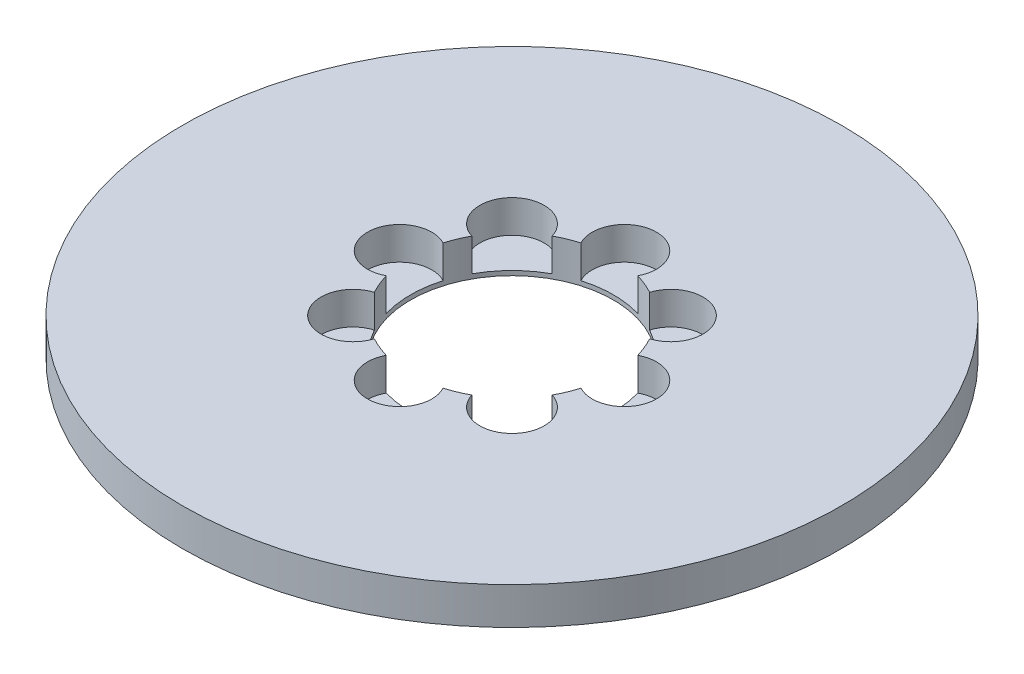
ISO-10303-21;
HEADER;
FILE_DESCRIPTION(('STEP AP214'),'2;1');
FILE_NAME('part.step','',(''),(''),'','','');
FILE_SCHEMA(('AUTOMOTIVE_DESIGN { 1 0 10303 214 1 1 1 1 }'));
ENDSEC;
DATA;
#1=APPLICATION_CONTEXT('core data for automotive mechanical design processes');
#2=APPLICATION_PROTOCOL_DEFINITION('international standard','automotive_design',2000,#1);
#3=PRODUCT_CONTEXT('',#1,'mechanical');
#4=PRODUCT('Part','Part','',(#3));
#5=PRODUCT_RELATED_PRODUCT_CATEGORY('part','',(#4));
#6=PRODUCT_DEFINITION_FORMATION('','',#4);
#7=PRODUCT_DEFINITION_CONTEXT('part definition',#1,'design');
#8=PRODUCT_DEFINITION('design','',#6,#7);
#9=PRODUCT_DEFINITION_SHAPE('','',#8);
#10=(LENGTH_UNIT() NAMED_UNIT(*) SI_UNIT(.MILLI.,.METRE.));
#11=(NAMED_UNIT(*) PLANE_ANGLE_UNIT() SI_UNIT($,.RADIAN.));
#12=(NAMED_UNIT(*) SI_UNIT($,.STERADIAN.) SOLID_ANGLE_UNIT());
#13=UNCERTAINTY_MEASURE_WITH_UNIT(LENGTH_MEASURE(1.E-05),#10,'distance_accuracy_value','');
#14=(GEOMETRIC_REPRESENTATION_CONTEXT(3) GLOBAL_UNCERTAINTY_ASSIGNED_CONTEXT((#13)) GLOBAL_UNIT_ASSIGNED_CONTEXT((#10,
#11,#12)) REPRESENTATION_CONTEXT('',''));
#15=CARTESIAN_POINT('',(0.,0.,0.));
#16=DIRECTION('',(0.,0.,1.));
#17=DIRECTION('',(1.,0.,0.));
#18=AXIS2_PLACEMENT_3D('',#15,#16,#17);
#19=CARTESIAN_POINT('',(0.,11.,0.));
#20=DIRECTION('',(0.,-1.,0.));
#21=DIRECTION('',(0.,0.,-1.));
#22=AXIS2_PLACEMENT_3D('',#19,#20,#21);
#23=CYLINDRICAL_SURFACE('',#22,97.5);
#24=CARTESIAN_POINT('',(0.,11.,0.));
#25=DIRECTION('',(0.,1.,0.));
#26=DIRECTION('',(0.,0.,1.));
#27=AXIS2_PLACEMENT_3D('',#24,#25,#26);
#28=CIRCLE('',#27,97.5);
#29=CARTESIAN_POINT('',(0.,11.,97.5));
#30=VERTEX_POINT('',#29);
#31=EDGE_CURVE('E195',#30,#30,#28,.T.);
#32=ORIENTED_EDGE('',*,*,#31,.F.);
#33=EDGE_LOOP('',(#32));
#34=FACE_BOUND('',#33,.T.);
#35=CARTESIAN_POINT('',(0.,0.,0.));
#36=DIRECTION('',(0.,1.,0.));
#37=DIRECTION('',(0.,0.,1.));
#38=AXIS2_PLACEMENT_3D('',#35,#36,#37);
#39=CIRCLE('',#38,97.5);
#40=CARTESIAN_POINT('',(0.,0.,97.5));
#41=VERTEX_POINT('',#40);
#42=EDGE_CURVE('E179',#41,#41,#39,.T.);
#43=ORIENTED_EDGE('',*,*,#42,.T.);
#44=EDGE_LOOP('',(#43));
#45=FACE_BOUND('',#44,.T.);
#46=ADVANCED_FACE('F39',(#34,#45),#23,.T.);
#47=CARTESIAN_POINT('',(0.,11.,0.));
#48=DIRECTION('',(0.,1.,0.));
#49=DIRECTION('',(0.,0.,1.));
#50=AXIS2_PLACEMENT_3D('',#47,#48,#49);
#51=PLANE('',#50);
#52=CARTESIAN_POINT('',(1.16039315757414E-13,11.,33.2349809424624));
#53=DIRECTION('',(0.,1.,0.));
#54=DIRECTION('',(1.,0.,0.));
#55=AXIS2_PLACEMENT_3D('',#52,#53,#54);
#56=CIRCLE('',#55,9.51243679470091);
#57=CARTESIAN_POINT('',(-8.41326540884641,11.,28.7961276070292));
#58=VERTEX_POINT('',#57);
#59=CARTESIAN_POINT('',(8.41326540884661,11.,28.7961276070291));
#60=VERTEX_POINT('',#59);
#61=EDGE_CURVE('E176',#58,#60,#56,.T.);
#62=ORIENTED_EDGE('',*,*,#61,.F.);
#63=CARTESIAN_POINT('',(0.,11.,0.));
#64=DIRECTION('',(0.,1.,0.));
#65=DIRECTION('',(0.,0.,1.));
#66=AXIS2_PLACEMENT_3D('',#63,#64,#65);
#67=CIRCLE('',#66,30.);
#68=CARTESIAN_POINT('',(-14.4128600803258,11.,26.3110141253611));
#69=VERTEX_POINT('',#68);
#70=EDGE_CURVE('E166',#69,#58,#67,.T.);
#71=ORIENTED_EDGE('',*,*,#70,.F.);
#72=CARTESIAN_POINT('',(-23.5006803970208,11.,23.5006803970209));
#73=DIRECTION('',(0.,1.,0.));
#74=DIRECTION('',(0.707106781186549,0.,0.707106781186546));
#75=AXIS2_PLACEMENT_3D('',#72,#73,#74);
#76=CIRCLE('',#75,9.51243679470091);
#77=CARTESIAN_POINT('',(-26.311014125361,11.,14.4128600803259));
#78=VERTEX_POINT('',#77);
#79=EDGE_CURVE('E147',#78,#69,#76,.T.);
#80=ORIENTED_EDGE('',*,*,#79,.F.);
#81=CARTESIAN_POINT('',(-28.7961276070292,11.,8.41326540884651));
#82=VERTEX_POINT('',#81);
#83=EDGE_CURVE('E180',#82,#78,#67,.T.);
#84=ORIENTED_EDGE('',*,*,#83,.F.);
#85=CARTESIAN_POINT('',(-33.2349809424624,11.,0.));
#86=DIRECTION('',(0.,1.,0.));
#87=DIRECTION('',(0.,0.,1.));
#88=AXIS2_PLACEMENT_3D('',#85,#86,#87);
#89=CIRCLE('',#88,9.51243679470091);
#90=CARTESIAN_POINT('',(-28.7961276070292,11.,-8.41326540884651));
#91=VERTEX_POINT('',#90);
#92=EDGE_CURVE('E186',#91,#82,#89,.T.);
#93=ORIENTED_EDGE('',*,*,#92,.F.);
#94=CARTESIAN_POINT('',(-26.3110141253612,11.,-14.4128600803256));
#95=VERTEX_POINT('',#94);
#96=EDGE_CURVE('E182',#95,#91,#67,.T.);
#97=ORIENTED_EDGE('',*,*,#96,.F.);
#98=CARTESIAN_POINT('',(-23.5006803970211,11.,-23.5006803970205));
#99=DIRECTION('',(0.,1.,0.));
#100=DIRECTION('',(-0.707106781186539,0.,0.707106781186556));
#101=AXIS2_PLACEMENT_3D('',#98,#99,#100);
#102=CIRCLE('',#101,9.51243679470091);
#103=CARTESIAN_POINT('',(-14.4128600803262,11.,-26.3110141253609));
#104=VERTEX_POINT('',#103);
#105=EDGE_CURVE('E446',#104,#95,#102,.T.);
#106=ORIENTED_EDGE('',*,*,#105,.F.);
#107=CARTESIAN_POINT('',(-8.41326540884681,11.,-28.7961276070291));
#108=VERTEX_POINT('',#107);
#109=EDGE_CURVE('E452',#108,#104,#67,.T.);
#110=ORIENTED_EDGE('',*,*,#109,.F.);
#111=CARTESIAN_POINT('',(-3.48117947272244E-13,11.,-33.2349809424624));
#112=DIRECTION('',(0.,1.,0.));
#113=DIRECTION('',(-1.,0.,0.));
#114=AXIS2_PLACEMENT_3D('',#111,#112,#113);
#115=CIRCLE('',#114,9.51243679470091);
#116=CARTESIAN_POINT('',(8.4132654088462,11.,-28.7961276070292));
#117=VERTEX_POINT('',#116);
#118=EDGE_CURVE('E477',#117,#108,#115,.T.);
#119=ORIENTED_EDGE('',*,*,#118,.F.);
#120=CARTESIAN_POINT('',(14.4128600803257,11.,-26.3110141253612));
#121=VERTEX_POINT('',#120);
#122=EDGE_CURVE('E460',#121,#117,#67,.T.);
#123=ORIENTED_EDGE('',*,*,#122,.F.);
#124=CARTESIAN_POINT('',(23.5006803970206,11.,-23.500680397021));
#125=DIRECTION('',(0.,1.,0.));
#126=DIRECTION('',(-0.707106781186554,0.,-0.707106781186541));
#127=AXIS2_PLACEMENT_3D('',#124,#125,#126);
#128=CIRCLE('',#127,9.51243679470091);
#129=CARTESIAN_POINT('',(26.3110141253609,11.,-14.4128600803261));
#130=VERTEX_POINT('',#129);
#131=EDGE_CURVE('E464',#130,#121,#128,.T.);
#132=ORIENTED_EDGE('',*,*,#131,.F.);
#133=CARTESIAN_POINT('',(28.7961276070292,11.,-8.41326540884651));
#134=VERTEX_POINT('',#133);
#135=EDGE_CURVE('E459',#134,#130,#67,.T.);
#136=ORIENTED_EDGE('',*,*,#135,.F.);
#137=CARTESIAN_POINT('',(33.2349809424624,11.,0.));
#138=DIRECTION('',(0.,1.,0.));
#139=DIRECTION('',(0.,0.,-1.));
#140=AXIS2_PLACEMENT_3D('',#137,#138,#139);
#141=CIRCLE('',#140,9.51243679470091);
#142=CARTESIAN_POINT('',(28.7961276070292,11.,8.41326540884651));
#143=VERTEX_POINT('',#142);
#144=EDGE_CURVE('E469',#143,#134,#141,.T.);
#145=ORIENTED_EDGE('',*,*,#144,.F.);
#146=CARTESIAN_POINT('',(26.3110141253611,11.,14.4128600803258));
#147=VERTEX_POINT('',#146);
#148=EDGE_CURVE('E181',#147,#143,#67,.T.);
#149=ORIENTED_EDGE('',*,*,#148,.F.);
#150=CARTESIAN_POINT('',(23.5006803970209,11.,23.5006803970207));
#151=DIRECTION('',(0.,1.,0.));
#152=DIRECTION('',(0.707106781186544,0.,-0.707106781186551));
#153=AXIS2_PLACEMENT_3D('',#150,#151,#152);
#154=CIRCLE('',#153,9.51243679470091);
#155=CARTESIAN_POINT('',(14.412860080326,11.,26.311014125361));
#156=VERTEX_POINT('',#155);
#157=EDGE_CURVE('E475',#156,#147,#154,.T.);
#158=ORIENTED_EDGE('',*,*,#157,.F.);
#159=EDGE_CURVE('E177',#60,#156,#67,.T.);
#160=ORIENTED_EDGE('',*,*,#159,.F.);
#161=EDGE_LOOP('',(#62,#71,#80,#84,#93,#97,#106,#110,#119,#123,#132,#136,#145,#149,#158,#160));
#162=FACE_BOUND('',#161,.T.);
#163=ORIENTED_EDGE('',*,*,#31,.T.);
#164=EDGE_LOOP('',(#163));
#165=FACE_BOUND('',#164,.T.);
#166=ADVANCED_FACE('F172',(#162,#165),#51,.T.);
#167=CARTESIAN_POINT('',(0.,0.,0.));
#168=DIRECTION('',(0.,1.,0.));
#169=DIRECTION('',(0.,0.,1.));
#170=AXIS2_PLACEMENT_3D('',#167,#168,#169);
#171=PLANE('',#170);
#172=CARTESIAN_POINT('',(0.,0.,0.));
#173=DIRECTION('',(0.,1.,0.));
#174=DIRECTION('',(0.,0.,1.));
#175=AXIS2_PLACEMENT_3D('',#172,#173,#174);
#176=CIRCLE('',#175,30.);
#177=CARTESIAN_POINT('',(0.,0.,30.));
#178=VERTEX_POINT('',#177);
#179=EDGE_CURVE('E187',#178,#178,#176,.T.);
#180=ORIENTED_EDGE('',*,*,#179,.T.);
#181=EDGE_LOOP('',(#180));
#182=FACE_BOUND('',#181,.T.);
#183=ORIENTED_EDGE('',*,*,#42,.F.);
#184=EDGE_LOOP('',(#183));
#185=FACE_BOUND('',#184,.T.);
#186=ADVANCED_FACE('F270',(#182,#185),#171,.F.);
#187=CARTESIAN_POINT('',(0.,11.,0.));
#188=DIRECTION('',(0.,-1.,0.));
#189=DIRECTION('',(0.,0.,-1.));
#190=AXIS2_PLACEMENT_3D('',#187,#188,#189);
#191=CYLINDRICAL_SURFACE('',#190,30.);
#192=DIRECTION('',(0.,1.,0.));
#193=VECTOR('',#192,1.);
#194=CARTESIAN_POINT('',(-8.41326540884641,6.16684092337857,28.7961276070292));
#195=LINE('',#194,#193);
#196=CARTESIAN_POINT('',(-8.41326540884641,1.33368184675714,28.7961276070292));
#197=VERTEX_POINT('',#196);
#198=EDGE_CURVE('E11',#197,#58,#195,.T.);
#199=ORIENTED_EDGE('',*,*,#198,.F.);
#200=CARTESIAN_POINT('',(0.,1.33368184675714,0.));
#201=DIRECTION('',(0.,1.,0.));
#202=DIRECTION('',(0.,0.,1.));
#203=AXIS2_PLACEMENT_3D('',#200,#201,#202);
#204=CIRCLE('',#203,30.);
#205=CARTESIAN_POINT('',(8.41326540884661,1.33368184675714,28.7961276070291));
#206=VERTEX_POINT('',#205);
#207=EDGE_CURVE('E250',#197,#206,#204,.T.);
#208=ORIENTED_EDGE('',*,*,#207,.T.);
#209=DIRECTION('',(0.,1.,0.));
#210=VECTOR('',#209,1.);
#211=CARTESIAN_POINT('',(8.41326540884661,6.16684092337857,28.7961276070291));
#212=LINE('',#211,#210);
#213=EDGE_CURVE('E46',#60,#206,#212,.F.);
#214=ORIENTED_EDGE('',*,*,#213,.F.);
#215=ORIENTED_EDGE('',*,*,#159,.T.);
#216=DIRECTION('',(0.,1.,0.));
#217=VECTOR('',#216,1.);
#218=CARTESIAN_POINT('',(14.412860080326,6.16684092337857,26.311014125361));
#219=LINE('',#218,#217);
#220=CARTESIAN_POINT('',(14.412860080326,1.33368184675714,26.311014125361));
#221=VERTEX_POINT('',#220);
#222=EDGE_CURVE('E244',#221,#156,#219,.T.);
#223=ORIENTED_EDGE('',*,*,#222,.F.);
#224=CARTESIAN_POINT('',(0.,1.33368184675714,0.));
#225=DIRECTION('',(0.,1.,0.));
#226=DIRECTION('',(0.,0.,1.));
#227=AXIS2_PLACEMENT_3D('',#224,#225,#226);
#228=CIRCLE('',#227,30.);
#229=CARTESIAN_POINT('',(26.3110141253611,1.33368184675714,14.4128600803258));
#230=VERTEX_POINT('',#229);
#231=EDGE_CURVE('E238',#221,#230,#228,.T.);
#232=ORIENTED_EDGE('',*,*,#231,.T.);
#233=DIRECTION('',(0.,1.,0.));
#234=VECTOR('',#233,1.);
#235=CARTESIAN_POINT('',(26.3110141253611,6.16684092337857,14.4128600803258));
#236=LINE('',#235,#234);
#237=EDGE_CURVE('E242',#147,#230,#236,.F.);
#238=ORIENTED_EDGE('',*,*,#237,.F.);
#239=ORIENTED_EDGE('',*,*,#148,.T.);
#240=DIRECTION('',(0.,1.,0.));
#241=VECTOR('',#240,1.);
#242=CARTESIAN_POINT('',(28.7961276070292,6.16684092337857,8.41326540884651));
#243=LINE('',#242,#241);
#244=CARTESIAN_POINT('',(28.7961276070292,1.33368184675714,8.41326540884651));
#245=VERTEX_POINT('',#244);
#246=EDGE_CURVE('E236',#245,#143,#243,.T.);
#247=ORIENTED_EDGE('',*,*,#246,.F.);
#248=CARTESIAN_POINT('',(0.,1.33368184675714,0.));
#249=DIRECTION('',(0.,1.,0.));
#250=DIRECTION('',(0.,0.,1.));
#251=AXIS2_PLACEMENT_3D('',#248,#249,#250);
#252=CIRCLE('',#251,30.);
#253=CARTESIAN_POINT('',(28.7961276070292,1.33368184675714,-8.41326540884651));
#254=VERTEX_POINT('',#253);
#255=EDGE_CURVE('E235',#245,#254,#252,.T.);
#256=ORIENTED_EDGE('',*,*,#255,.T.);
#257=DIRECTION('',(0.,1.,0.));
#258=VECTOR('',#257,1.);
#259=CARTESIAN_POINT('',(28.7961276070292,6.16684092337857,-8.41326540884651));
#260=LINE('',#259,#258);
#261=EDGE_CURVE('E234',#134,#254,#260,.F.);
#262=ORIENTED_EDGE('',*,*,#261,.F.);
#263=ORIENTED_EDGE('',*,*,#135,.T.);
#264=DIRECTION('',(0.,1.,0.));
#265=VECTOR('',#264,1.);
#266=CARTESIAN_POINT('',(26.3110141253609,6.16684092337857,-14.4128600803261));
#267=LINE('',#266,#265);
#268=CARTESIAN_POINT('',(26.3110141253609,1.33368184675714,-14.4128600803261));
#269=VERTEX_POINT('',#268);
#270=EDGE_CURVE('E229',#269,#130,#267,.T.);
#271=ORIENTED_EDGE('',*,*,#270,.F.);
#272=CARTESIAN_POINT('',(0.,1.33368184675714,0.));
#273=DIRECTION('',(0.,1.,0.));
#274=DIRECTION('',(0.,0.,1.));
#275=AXIS2_PLACEMENT_3D('',#272,#273,#274);
#276=CIRCLE('',#275,30.);
#277=CARTESIAN_POINT('',(14.4128600803257,1.33368184675714,-26.3110141253612));
#278=VERTEX_POINT('',#277);
#279=EDGE_CURVE('E221',#269,#278,#276,.T.);
#280=ORIENTED_EDGE('',*,*,#279,.T.);
#281=DIRECTION('',(0.,1.,0.));
#282=VECTOR('',#281,1.);
#283=CARTESIAN_POINT('',(14.4128600803257,6.16684092337857,-26.3110141253612));
#284=LINE('',#283,#282);
#285=EDGE_CURVE('E230',#121,#278,#284,.F.);
#286=ORIENTED_EDGE('',*,*,#285,.F.);
#287=ORIENTED_EDGE('',*,*,#122,.T.);
#288=DIRECTION('',(0.,1.,0.));
#289=VECTOR('',#288,1.);
#290=CARTESIAN_POINT('',(8.41326540884621,6.16684092337857,-28.7961276070292));
#291=LINE('',#290,#289);
#292=CARTESIAN_POINT('',(8.4132654088462,1.33368184675714,-28.7961276070292));
#293=VERTEX_POINT('',#292);
#294=EDGE_CURVE('E225',#293,#117,#291,.T.);
#295=ORIENTED_EDGE('',*,*,#294,.F.);
#296=CARTESIAN_POINT('',(0.,1.33368184675714,0.));
#297=DIRECTION('',(0.,1.,0.));
#298=DIRECTION('',(0.,0.,1.));
#299=AXIS2_PLACEMENT_3D('',#296,#297,#298);
#300=CIRCLE('',#299,30.);
#301=CARTESIAN_POINT('',(-8.41326540884681,1.33368184675714,-28.7961276070291));
#302=VERTEX_POINT('',#301);
#303=EDGE_CURVE('E216',#293,#302,#300,.T.);
#304=ORIENTED_EDGE('',*,*,#303,.T.);
#305=DIRECTION('',(0.,1.,0.));
#306=VECTOR('',#305,1.);
#307=CARTESIAN_POINT('',(-8.41326540884681,6.16684092337857,-28.7961276070291));
#308=LINE('',#307,#306);
#309=EDGE_CURVE('E218',#108,#302,#308,.F.);
#310=ORIENTED_EDGE('',*,*,#309,.F.);
#311=ORIENTED_EDGE('',*,*,#109,.T.);
#312=DIRECTION('',(0.,1.,0.));
#313=VECTOR('',#312,1.);
#314=CARTESIAN_POINT('',(-14.4128600803262,6.16684092337857,-26.3110141253609));
#315=LINE('',#314,#313);
#316=CARTESIAN_POINT('',(-14.4128600803262,1.33368184675714,-26.3110141253609));
#317=VERTEX_POINT('',#316);
#318=EDGE_CURVE('E212',#317,#104,#315,.T.);
#319=ORIENTED_EDGE('',*,*,#318,.F.);
#320=CARTESIAN_POINT('',(0.,1.33368184675714,0.));
#321=DIRECTION('',(0.,1.,0.));
#322=DIRECTION('',(0.,0.,1.));
#323=AXIS2_PLACEMENT_3D('',#320,#321,#322);
#324=CIRCLE('',#323,30.);
#325=CARTESIAN_POINT('',(-26.3110141253612,1.33368184675714,-14.4128600803256));
#326=VERTEX_POINT('',#325);
#327=EDGE_CURVE('E208',#317,#326,#324,.T.);
#328=ORIENTED_EDGE('',*,*,#327,.T.);
#329=DIRECTION('',(0.,1.,0.));
#330=VECTOR('',#329,1.);
#331=CARTESIAN_POINT('',(-26.3110141253612,6.16684092337857,-14.4128600803256));
#332=LINE('',#331,#330);
#333=EDGE_CURVE('E211',#95,#326,#332,.F.);
#334=ORIENTED_EDGE('',*,*,#333,.F.);
#335=ORIENTED_EDGE('',*,*,#96,.T.);
#336=DIRECTION('',(0.,1.,0.));
#337=VECTOR('',#336,1.);
#338=CARTESIAN_POINT('',(-28.7961276070292,6.16684092337857,-8.41326540884651));
#339=LINE('',#338,#337);
#340=CARTESIAN_POINT('',(-28.7961276070292,1.33368184675714,-8.41326540884651));
#341=VERTEX_POINT('',#340);
#342=EDGE_CURVE('E201',#341,#91,#339,.T.);
#343=ORIENTED_EDGE('',*,*,#342,.F.);
#344=CARTESIAN_POINT('',(0.,1.33368184675714,0.));
#345=DIRECTION('',(0.,1.,0.));
#346=DIRECTION('',(0.,0.,1.));
#347=AXIS2_PLACEMENT_3D('',#344,#345,#346);
#348=CIRCLE('',#347,30.);
#349=CARTESIAN_POINT('',(-28.7961276070292,1.33368184675714,8.41326540884651));
#350=VERTEX_POINT('',#349);
#351=EDGE_CURVE('E194',#341,#350,#348,.T.);
#352=ORIENTED_EDGE('',*,*,#351,.T.);
#353=DIRECTION('',(0.,1.,0.));
#354=VECTOR('',#353,1.);
#355=CARTESIAN_POINT('',(-28.7961276070292,6.16684092337857,8.41326540884651));
#356=LINE('',#355,#354);
#357=EDGE_CURVE('E199',#82,#350,#356,.F.);
#358=ORIENTED_EDGE('',*,*,#357,.F.);
#359=ORIENTED_EDGE('',*,*,#83,.T.);
#360=DIRECTION('',(0.,1.,0.));
#361=VECTOR('',#360,1.);
#362=CARTESIAN_POINT('',(-26.311014125361,6.16684092337857,14.4128600803259));
#363=LINE('',#362,#361);
#364=CARTESIAN_POINT('',(-26.311014125361,1.33368184675714,14.4128600803259));
#365=VERTEX_POINT('',#364);
#366=EDGE_CURVE('E160',#365,#78,#363,.T.);
#367=ORIENTED_EDGE('',*,*,#366,.F.);
#368=CARTESIAN_POINT('',(0.,1.33368184675714,0.));
#369=DIRECTION('',(0.,1.,0.));
#370=DIRECTION('',(0.,0.,1.));
#371=AXIS2_PLACEMENT_3D('',#368,#369,#370);
#372=CIRCLE('',#371,30.);
#373=CARTESIAN_POINT('',(-14.4128600803258,1.33368184675714,26.3110141253611));
#374=VERTEX_POINT('',#373);
#375=EDGE_CURVE('E168',#365,#374,#372,.T.);
#376=ORIENTED_EDGE('',*,*,#375,.T.);
#377=DIRECTION('',(0.,1.,0.));
#378=VECTOR('',#377,1.);
#379=CARTESIAN_POINT('',(-14.4128600803258,6.16684092337857,26.3110141253611));
#380=LINE('',#379,#378);
#381=EDGE_CURVE('E152',#69,#374,#380,.F.);
#382=ORIENTED_EDGE('',*,*,#381,.F.);
#383=ORIENTED_EDGE('',*,*,#70,.T.);
#384=EDGE_LOOP('',(#199,#208,#214,#215,#223,#232,#238,#239,#247,#256,#262,#263,#271,#280,#286,
#287,#295,#304,#310,#311,#319,#328,#334,#335,#343,#352,#358,#359,#367,#376,#382,#383));
#385=FACE_BOUND('',#384,.T.);
#386=ORIENTED_EDGE('',*,*,#179,.F.);
#387=EDGE_LOOP('',(#386));
#388=FACE_BOUND('',#387,.T.);
#389=ADVANCED_FACE('F170',(#385,#388),#191,.F.);
#390=CARTESIAN_POINT('',(-33.2349809424624,1.33368184675714,0.));
#391=DIRECTION('',(0.,1.,0.));
#392=DIRECTION('',(0.,0.,1.));
#393=AXIS2_PLACEMENT_3D('',#390,#391,#392);
#394=CYLINDRICAL_SURFACE('',#393,9.51243679470091);
#395=ORIENTED_EDGE('',*,*,#342,.T.);
#396=ORIENTED_EDGE('',*,*,#92,.T.);
#397=ORIENTED_EDGE('',*,*,#357,.T.);
#398=CARTESIAN_POINT('',(-33.2349809424624,1.33368184675714,0.));
#399=DIRECTION('',(0.,1.,0.));
#400=DIRECTION('',(0.,0.,1.));
#401=AXIS2_PLACEMENT_3D('',#398,#399,#400);
#402=CIRCLE('',#401,9.51243679470091);
#403=EDGE_CURVE('E191',#341,#350,#402,.T.);
#404=ORIENTED_EDGE('',*,*,#403,.F.);
#405=EDGE_LOOP('',(#395,#396,#397,#404));
#406=FACE_BOUND('',#405,.T.);
#407=ADVANCED_FACE('F279',(#406),#394,.F.);
#408=CARTESIAN_POINT('',(-33.2349809424624,1.33368184675714,0.));
#409=DIRECTION('',(0.,1.,0.));
#410=DIRECTION('',(0.,0.,1.));
#411=AXIS2_PLACEMENT_3D('',#408,#409,#410);
#412=PLANE('',#411);
#413=ORIENTED_EDGE('',*,*,#403,.T.);
#414=ORIENTED_EDGE('',*,*,#351,.F.);
#415=EDGE_LOOP('',(#413,#414));
#416=FACE_BOUND('',#415,.T.);
#417=ADVANCED_FACE('F285',(#416),#412,.T.);
#418=CARTESIAN_POINT('',(-23.5006803970208,1.33368184675714,23.5006803970209));
#419=DIRECTION('',(0.,1.,0.));
#420=DIRECTION('',(0.,0.,1.));
#421=AXIS2_PLACEMENT_3D('',#418,#419,#420);
#422=CYLINDRICAL_SURFACE('',#421,9.51243679470091);
#423=ORIENTED_EDGE('',*,*,#366,.T.);
#424=ORIENTED_EDGE('',*,*,#79,.T.);
#425=ORIENTED_EDGE('',*,*,#381,.T.);
#426=CARTESIAN_POINT('',(-23.5006803970208,1.33368184675714,23.5006803970209));
#427=DIRECTION('',(0.,1.,0.));
#428=DIRECTION('',(0.707106781186549,0.,0.707106781186546));
#429=AXIS2_PLACEMENT_3D('',#426,#427,#428);
#430=CIRCLE('',#429,9.51243679470091);
#431=EDGE_CURVE('E165',#365,#374,#430,.T.);
#432=ORIENTED_EDGE('',*,*,#431,.F.);
#433=EDGE_LOOP('',(#423,#424,#425,#432));
#434=FACE_BOUND('',#433,.T.);
#435=ADVANCED_FACE('F155',(#434),#422,.F.);
#436=CARTESIAN_POINT('',(-23.5006803970208,1.33368184675714,23.5006803970209));
#437=DIRECTION('',(0.,1.,0.));
#438=DIRECTION('',(0.707106781186549,0.,0.707106781186546));
#439=AXIS2_PLACEMENT_3D('',#436,#437,#438);
#440=PLANE('',#439);
#441=ORIENTED_EDGE('',*,*,#431,.T.);
#442=ORIENTED_EDGE('',*,*,#375,.F.);
#443=EDGE_LOOP('',(#441,#442));
#444=FACE_BOUND('',#443,.T.);
#445=ADVANCED_FACE('F288',(#444),#440,.T.);
#446=CARTESIAN_POINT('',(-23.5006803970211,1.33368184675714,-23.5006803970205));
#447=DIRECTION('',(0.,1.,0.));
#448=DIRECTION('',(0.,0.,1.));
#449=AXIS2_PLACEMENT_3D('',#446,#447,#448);
#450=CYLINDRICAL_SURFACE('',#449,9.51243679470091);
#451=ORIENTED_EDGE('',*,*,#318,.T.);
#452=ORIENTED_EDGE('',*,*,#105,.T.);
#453=ORIENTED_EDGE('',*,*,#333,.T.);
#454=CARTESIAN_POINT('',(-23.5006803970211,1.33368184675714,-23.5006803970205));
#455=DIRECTION('',(0.,1.,0.));
#456=DIRECTION('',(-0.707106781186539,0.,0.707106781186556));
#457=AXIS2_PLACEMENT_3D('',#454,#455,#456);
#458=CIRCLE('',#457,9.51243679470091);
#459=EDGE_CURVE('E447',#317,#326,#458,.T.);
#460=ORIENTED_EDGE('',*,*,#459,.F.);
#461=EDGE_LOOP('',(#451,#452,#453,#460));
#462=FACE_BOUND('',#461,.T.);
#463=ADVANCED_FACE('F295',(#462),#450,.F.);
#464=CARTESIAN_POINT('',(-23.5006803970211,1.33368184675714,-23.5006803970205));
#465=DIRECTION('',(0.,1.,0.));
#466=DIRECTION('',(-0.707106781186539,0.,0.707106781186556));
#467=AXIS2_PLACEMENT_3D('',#464,#465,#466);
#468=PLANE('',#467);
#469=ORIENTED_EDGE('',*,*,#459,.T.);
#470=ORIENTED_EDGE('',*,*,#327,.F.);
#471=EDGE_LOOP('',(#469,#470));
#472=FACE_BOUND('',#471,.T.);
#473=ADVANCED_FACE('F375',(#472),#468,.T.);
#474=CARTESIAN_POINT('',(-3.48117947272244E-13,1.33368184675714,-33.2349809424624));
#475=DIRECTION('',(0.,1.,0.));
#476=DIRECTION('',(0.,0.,1.));
#477=AXIS2_PLACEMENT_3D('',#474,#475,#476);
#478=CYLINDRICAL_SURFACE('',#477,9.51243679470091);
#479=ORIENTED_EDGE('',*,*,#294,.T.);
#480=ORIENTED_EDGE('',*,*,#118,.T.);
#481=ORIENTED_EDGE('',*,*,#309,.T.);
#482=CARTESIAN_POINT('',(-3.48117947272244E-13,1.33368184675714,-33.2349809424624));
#483=DIRECTION('',(0.,1.,0.));
#484=DIRECTION('',(-1.,0.,0.));
#485=AXIS2_PLACEMENT_3D('',#482,#483,#484);
#486=CIRCLE('',#485,9.51243679470091);
#487=EDGE_CURVE('E467',#293,#302,#486,.T.);
#488=ORIENTED_EDGE('',*,*,#487,.F.);
#489=EDGE_LOOP('',(#479,#480,#481,#488));
#490=FACE_BOUND('',#489,.T.);
#491=ADVANCED_FACE('F361',(#490),#478,.F.);
#492=CARTESIAN_POINT('',(-3.48117947272244E-13,1.33368184675714,-33.2349809424624));
#493=DIRECTION('',(0.,1.,0.));
#494=DIRECTION('',(-1.,0.,0.));
#495=AXIS2_PLACEMENT_3D('',#492,#493,#494);
#496=PLANE('',#495);
#497=ORIENTED_EDGE('',*,*,#487,.T.);
#498=ORIENTED_EDGE('',*,*,#303,.F.);
#499=EDGE_LOOP('',(#497,#498));
#500=FACE_BOUND('',#499,.T.);
#501=ADVANCED_FACE('F297',(#500),#496,.T.);
#502=CARTESIAN_POINT('',(23.5006803970206,1.33368184675714,-23.500680397021));
#503=DIRECTION('',(0.,1.,0.));
#504=DIRECTION('',(0.,0.,1.));
#505=AXIS2_PLACEMENT_3D('',#502,#503,#504);
#506=CYLINDRICAL_SURFACE('',#505,9.51243679470091);
#507=ORIENTED_EDGE('',*,*,#270,.T.);
#508=ORIENTED_EDGE('',*,*,#131,.T.);
#509=ORIENTED_EDGE('',*,*,#285,.T.);
#510=CARTESIAN_POINT('',(23.5006803970206,1.33368184675714,-23.500680397021));
#511=DIRECTION('',(0.,1.,0.));
#512=DIRECTION('',(-0.707106781186554,0.,-0.707106781186541));
#513=AXIS2_PLACEMENT_3D('',#510,#511,#512);
#514=CIRCLE('',#513,9.51243679470091);
#515=EDGE_CURVE('E470',#269,#278,#514,.T.);
#516=ORIENTED_EDGE('',*,*,#515,.F.);
#517=EDGE_LOOP('',(#507,#508,#509,#516));
#518=FACE_BOUND('',#517,.T.);
#519=ADVANCED_FACE('F294',(#518),#506,.F.);
#520=CARTESIAN_POINT('',(23.5006803970206,1.33368184675714,-23.500680397021));
#521=DIRECTION('',(0.,1.,0.));
#522=DIRECTION('',(-0.707106781186554,0.,-0.707106781186541));
#523=AXIS2_PLACEMENT_3D('',#520,#521,#522);
#524=PLANE('',#523);
#525=ORIENTED_EDGE('',*,*,#515,.T.);
#526=ORIENTED_EDGE('',*,*,#279,.F.);
#527=EDGE_LOOP('',(#525,#526));
#528=FACE_BOUND('',#527,.T.);
#529=ADVANCED_FACE('F300',(#528),#524,.T.);
#530=CARTESIAN_POINT('',(33.2349809424624,1.33368184675714,0.));
#531=DIRECTION('',(0.,1.,0.));
#532=DIRECTION('',(0.,0.,1.));
#533=AXIS2_PLACEMENT_3D('',#530,#531,#532);
#534=CYLINDRICAL_SURFACE('',#533,9.51243679470091);
#535=ORIENTED_EDGE('',*,*,#246,.T.);
#536=ORIENTED_EDGE('',*,*,#144,.T.);
#537=ORIENTED_EDGE('',*,*,#261,.T.);
#538=CARTESIAN_POINT('',(33.2349809424624,1.33368184675714,0.));
#539=DIRECTION('',(0.,1.,0.));
#540=DIRECTION('',(0.,0.,-1.));
#541=AXIS2_PLACEMENT_3D('',#538,#539,#540);
#542=CIRCLE('',#541,9.51243679470091);
#543=EDGE_CURVE('E472',#245,#254,#542,.T.);
#544=ORIENTED_EDGE('',*,*,#543,.F.);
#545=EDGE_LOOP('',(#535,#536,#537,#544));
#546=FACE_BOUND('',#545,.T.);
#547=ADVANCED_FACE('F305',(#546),#534,.F.);
#548=CARTESIAN_POINT('',(33.2349809424624,1.33368184675714,0.));
#549=DIRECTION('',(0.,1.,0.));
#550=DIRECTION('',(0.,0.,-1.));
#551=AXIS2_PLACEMENT_3D('',#548,#549,#550);
#552=PLANE('',#551);
#553=ORIENTED_EDGE('',*,*,#543,.T.);
#554=ORIENTED_EDGE('',*,*,#255,.F.);
#555=EDGE_LOOP('',(#553,#554));
#556=FACE_BOUND('',#555,.T.);
#557=ADVANCED_FACE('F308',(#556),#552,.T.);
#558=CARTESIAN_POINT('',(23.5006803970209,1.33368184675714,23.5006803970207));
#559=DIRECTION('',(0.,1.,0.));
#560=DIRECTION('',(0.,0.,1.));
#561=AXIS2_PLACEMENT_3D('',#558,#559,#560);
#562=CYLINDRICAL_SURFACE('',#561,9.51243679470091);
#563=ORIENTED_EDGE('',*,*,#222,.T.);
#564=ORIENTED_EDGE('',*,*,#157,.T.);
#565=ORIENTED_EDGE('',*,*,#237,.T.);
#566=CARTESIAN_POINT('',(23.5006803970209,1.33368184675714,23.5006803970207));
#567=DIRECTION('',(0.,1.,0.));
#568=DIRECTION('',(0.707106781186544,0.,-0.707106781186551));
#569=AXIS2_PLACEMENT_3D('',#566,#567,#568);
#570=CIRCLE('',#569,9.51243679470091);
#571=EDGE_CURVE('E56',#221,#230,#570,.T.);
#572=ORIENTED_EDGE('',*,*,#571,.F.);
#573=EDGE_LOOP('',(#563,#564,#565,#572));
#574=FACE_BOUND('',#573,.T.);
#575=ADVANCED_FACE('F309',(#574),#562,.F.);
#576=CARTESIAN_POINT('',(23.5006803970209,1.33368184675714,23.5006803970207));
#577=DIRECTION('',(0.,1.,0.));
#578=DIRECTION('',(0.707106781186544,0.,-0.707106781186551));
#579=AXIS2_PLACEMENT_3D('',#576,#577,#578);
#580=PLANE('',#579);
#581=ORIENTED_EDGE('',*,*,#571,.T.);
#582=ORIENTED_EDGE('',*,*,#231,.F.);
#583=EDGE_LOOP('',(#581,#582));
#584=FACE_BOUND('',#583,.T.);
#585=ADVANCED_FACE('F256',(#584),#580,.T.);
#586=CARTESIAN_POINT('',(1.16039315757414E-13,1.33368184675714,33.2349809424624));
#587=DIRECTION('',(0.,1.,0.));
#588=DIRECTION('',(0.,0.,1.));
#589=AXIS2_PLACEMENT_3D('',#586,#587,#588);
#590=CYLINDRICAL_SURFACE('',#589,9.51243679470091);
#591=ORIENTED_EDGE('',*,*,#198,.T.);
#592=ORIENTED_EDGE('',*,*,#61,.T.);
#593=ORIENTED_EDGE('',*,*,#213,.T.);
#594=CARTESIAN_POINT('',(1.16039315757414E-13,1.33368184675714,33.2349809424624));
#595=DIRECTION('',(0.,1.,0.));
#596=DIRECTION('',(1.,0.,0.));
#597=AXIS2_PLACEMENT_3D('',#594,#595,#596);
#598=CIRCLE('',#597,9.51243679470091);
#599=EDGE_CURVE('E55',#197,#206,#598,.T.);
#600=ORIENTED_EDGE('',*,*,#599,.F.);
#601=EDGE_LOOP('',(#591,#592,#593,#600));
#602=FACE_BOUND('',#601,.T.);
#603=ADVANCED_FACE('F253',(#602),#590,.F.);
#604=CARTESIAN_POINT('',(1.16039315757414E-13,1.33368184675714,33.2349809424624));
#605=DIRECTION('',(0.,1.,0.));
#606=DIRECTION('',(1.,0.,0.));
#607=AXIS2_PLACEMENT_3D('',#604,#605,#606);
#608=PLANE('',#607);
#609=ORIENTED_EDGE('',*,*,#599,.T.);
#610=ORIENTED_EDGE('',*,*,#207,.F.);
#611=EDGE_LOOP('',(#609,#610));
#612=FACE_BOUND('',#611,.T.);
#613=ADVANCED_FACE('F252',(#612),#608,.T.);
#614=CLOSED_SHELL('',(#46,#166,#186,#389,#407,#417,#435,#445,#463,#473,#491,#501,#519,#529,#547,
#557,#575,#585,#603,#613));
#615=MANIFOLD_SOLID_BREP('B2',#614);
#616=ADVANCED_BREP_SHAPE_REPRESENTATION('',(#18,#615),#14);
#617=SHAPE_DEFINITION_REPRESENTATION(#9,#616);
ENDSEC;
END-ISO-10303-21;
